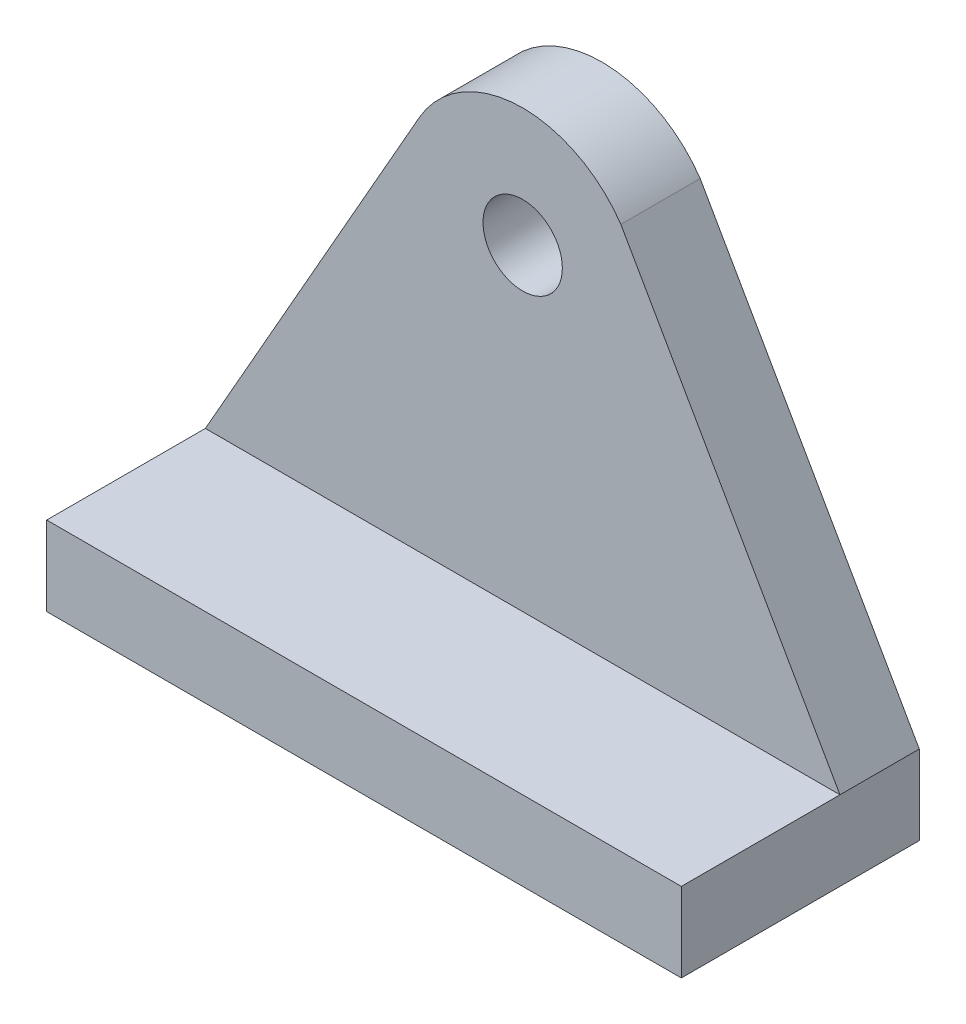
ISO-10303-21;
HEADER;
FILE_DESCRIPTION(('STEP AP214'),'2;1');
FILE_NAME('part.step','',(''),(''),'','','');
FILE_SCHEMA(('AUTOMOTIVE_DESIGN { 1 0 10303 214 1 1 1 1 }'));
ENDSEC;
DATA;
#1=APPLICATION_CONTEXT('core data for automotive mechanical design processes');
#2=APPLICATION_PROTOCOL_DEFINITION('international standard','automotive_design',2000,#1);
#3=PRODUCT_CONTEXT('',#1,'mechanical');
#4=PRODUCT('Part','Part','',(#3));
#5=PRODUCT_RELATED_PRODUCT_CATEGORY('part','',(#4));
#6=PRODUCT_DEFINITION_FORMATION('','',#4);
#7=PRODUCT_DEFINITION_CONTEXT('part definition',#1,'design');
#8=PRODUCT_DEFINITION('design','',#6,#7);
#9=PRODUCT_DEFINITION_SHAPE('','',#8);
#10=(LENGTH_UNIT() NAMED_UNIT(*) SI_UNIT(.MILLI.,.METRE.));
#11=(NAMED_UNIT(*) PLANE_ANGLE_UNIT() SI_UNIT($,.RADIAN.));
#12=(NAMED_UNIT(*) SI_UNIT($,.STERADIAN.) SOLID_ANGLE_UNIT());
#13=UNCERTAINTY_MEASURE_WITH_UNIT(LENGTH_MEASURE(1.E-05),#10,'distance_accuracy_value','');
#14=(GEOMETRIC_REPRESENTATION_CONTEXT(3) GLOBAL_UNCERTAINTY_ASSIGNED_CONTEXT((#13)) GLOBAL_UNIT_ASSIGNED_CONTEXT((#10,
#11,#12)) REPRESENTATION_CONTEXT('',''));
#15=CARTESIAN_POINT('',(0.,0.,0.));
#16=DIRECTION('',(0.,0.,1.));
#17=DIRECTION('',(1.,0.,0.));
#18=AXIS2_PLACEMENT_3D('',#15,#16,#17);
#19=CARTESIAN_POINT('',(10.27413218417,-11.9907770580973,2.));
#20=DIRECTION('',(-0.868834468468279,-0.495102682684555,0.));
#21=DIRECTION('',(0.495102682684555,-0.868834468468279,0.));
#22=AXIS2_PLACEMENT_3D('',#19,#20,#21);
#23=PLANE('',#22);
#24=DIRECTION('',(-0.495102682684555,0.868834468468279,0.));
#25=VECTOR('',#24,1.);
#26=CARTESIAN_POINT('',(10.27413218417,-11.9907770580973,0.));
#27=LINE('',#26,#25);
#28=CARTESIAN_POINT('',(8.,-8.,0.));
#29=VERTEX_POINT('',#28);
#30=CARTESIAN_POINT('',(2.47563651299595,1.6944686056464,0.));
#31=VERTEX_POINT('',#30);
#32=EDGE_CURVE('E173',#29,#31,#27,.T.);
#33=ORIENTED_EDGE('',*,*,#32,.T.);
#34=DIRECTION('',(0.,0.,-1.));
#35=VECTOR('',#34,1.);
#36=CARTESIAN_POINT('',(2.47563651299595,1.6944686056464,2.));
#37=LINE('',#36,#35);
#38=CARTESIAN_POINT('',(2.47563651299595,1.6944686056464,2.));
#39=VERTEX_POINT('',#38);
#40=EDGE_CURVE('E11',#39,#31,#37,.T.);
#41=ORIENTED_EDGE('',*,*,#40,.F.);
#42=DIRECTION('',(-0.495102682684555,0.868834468468279,0.));
#43=VECTOR('',#42,1.);
#44=CARTESIAN_POINT('',(10.27413218417,-11.9907770580973,2.));
#45=LINE('',#44,#43);
#46=CARTESIAN_POINT('',(8.,-8.,2.));
#47=VERTEX_POINT('',#46);
#48=EDGE_CURVE('E52',#47,#39,#45,.T.);
#49=ORIENTED_EDGE('',*,*,#48,.F.);
#50=DIRECTION('',(0.,0.,-1.));
#51=VECTOR('',#50,1.);
#52=CARTESIAN_POINT('',(8.,-8.,2.));
#53=LINE('',#52,#51);
#54=EDGE_CURVE('E74',#47,#29,#53,.T.);
#55=ORIENTED_EDGE('',*,*,#54,.T.);
#56=EDGE_LOOP('',(#33,#41,#49,#55));
#57=FACE_BOUND('',#56,.T.);
#58=ADVANCED_FACE('F33',(#57),#23,.F.);
#59=CARTESIAN_POINT('',(0.,0.,2.));
#60=DIRECTION('',(0.,0.,-1.));
#61=DIRECTION('',(-1.,0.,0.));
#62=AXIS2_PLACEMENT_3D('',#59,#60,#61);
#63=CYLINDRICAL_SURFACE('',#62,3.);
#64=CARTESIAN_POINT('',(0.,0.,0.));
#65=DIRECTION('',(0.,0.,1.));
#66=DIRECTION('',(1.,0.,0.));
#67=AXIS2_PLACEMENT_3D('',#64,#65,#66);
#68=CIRCLE('',#67,3.);
#69=CARTESIAN_POINT('',(-2.6078835214942,1.48288352149419,0.));
#70=VERTEX_POINT('',#69);
#71=EDGE_CURVE('E176',#31,#70,#68,.T.);
#72=ORIENTED_EDGE('',*,*,#71,.T.);
#73=DIRECTION('',(0.,0.,-1.));
#74=VECTOR('',#73,1.);
#75=CARTESIAN_POINT('',(-2.6078835214942,1.48288352149419,2.));
#76=LINE('',#75,#74);
#77=CARTESIAN_POINT('',(-2.6078835214942,1.48288352149419,2.));
#78=VERTEX_POINT('',#77);
#79=EDGE_CURVE('E43',#78,#70,#76,.T.);
#80=ORIENTED_EDGE('',*,*,#79,.F.);
#81=CARTESIAN_POINT('',(0.,0.,2.));
#82=DIRECTION('',(0.,0.,1.));
#83=DIRECTION('',(1.,0.,0.));
#84=AXIS2_PLACEMENT_3D('',#81,#82,#83);
#85=CIRCLE('',#84,3.);
#86=EDGE_CURVE('E79',#39,#78,#85,.T.);
#87=ORIENTED_EDGE('',*,*,#86,.F.);
#88=ORIENTED_EDGE('',*,*,#40,.T.);
#89=EDGE_LOOP('',(#72,#80,#87,#88));
#90=FACE_BOUND('',#89,.T.);
#91=ADVANCED_FACE('F175',(#90),#63,.T.);
#92=CARTESIAN_POINT('',(-10.2758546472716,-12.0024477620166,2.));
#93=DIRECTION('',(-0.869294507164732,0.494294507164732,0.));
#94=DIRECTION('',(-0.494294507164732,-0.869294507164732,0.));
#95=AXIS2_PLACEMENT_3D('',#92,#93,#94);
#96=PLANE('',#95);
#97=DIRECTION('',(0.494294507164732,0.869294507164732,0.));
#98=VECTOR('',#97,1.);
#99=CARTESIAN_POINT('',(-10.2758546472716,-12.0024477620166,0.));
#100=LINE('',#99,#98);
#101=CARTESIAN_POINT('',(-8.,-8.,0.));
#102=VERTEX_POINT('',#101);
#103=EDGE_CURVE('E70',#102,#70,#100,.T.);
#104=ORIENTED_EDGE('',*,*,#103,.F.);
#105=DIRECTION('',(0.,0.,-1.));
#106=VECTOR('',#105,1.);
#107=CARTESIAN_POINT('',(-8.,-8.,2.));
#108=LINE('',#107,#106);
#109=CARTESIAN_POINT('',(-8.,-8.,2.));
#110=VERTEX_POINT('',#109);
#111=EDGE_CURVE('E165',#110,#102,#108,.T.);
#112=ORIENTED_EDGE('',*,*,#111,.F.);
#113=DIRECTION('',(0.494294507164732,0.869294507164732,0.));
#114=VECTOR('',#113,1.);
#115=CARTESIAN_POINT('',(-10.2758546472716,-12.0024477620166,2.));
#116=LINE('',#115,#114);
#117=EDGE_CURVE('E152',#110,#78,#116,.T.);
#118=ORIENTED_EDGE('',*,*,#117,.T.);
#119=ORIENTED_EDGE('',*,*,#79,.T.);
#120=EDGE_LOOP('',(#104,#112,#118,#119));
#121=FACE_BOUND('',#120,.T.);
#122=ADVANCED_FACE('F182',(#121),#96,.T.);
#123=CARTESIAN_POINT('',(0.,0.,2.));
#124=DIRECTION('',(0.,0.,-1.));
#125=DIRECTION('',(-1.,0.,0.));
#126=AXIS2_PLACEMENT_3D('',#123,#124,#125);
#127=CYLINDRICAL_SURFACE('',#126,0.999999999999999);
#128=CARTESIAN_POINT('',(0.,0.,2.));
#129=DIRECTION('',(0.,0.,1.));
#130=DIRECTION('',(1.,0.,0.));
#131=AXIS2_PLACEMENT_3D('',#128,#129,#130);
#132=CIRCLE('',#131,0.999999999999999);
#133=CARTESIAN_POINT('',(0.999999999999999,0.,2.));
#134=VERTEX_POINT('',#133);
#135=EDGE_CURVE('E148',#134,#134,#132,.T.);
#136=ORIENTED_EDGE('',*,*,#135,.T.);
#137=EDGE_LOOP('',(#136));
#138=FACE_BOUND('',#137,.T.);
#139=CARTESIAN_POINT('',(0.,0.,0.));
#140=DIRECTION('',(0.,0.,1.));
#141=DIRECTION('',(1.,0.,0.));
#142=AXIS2_PLACEMENT_3D('',#139,#140,#141);
#143=CIRCLE('',#142,0.999999999999999);
#144=CARTESIAN_POINT('',(0.999999999999999,0.,0.));
#145=VERTEX_POINT('',#144);
#146=EDGE_CURVE('E146',#145,#145,#143,.T.);
#147=ORIENTED_EDGE('',*,*,#146,.F.);
#148=EDGE_LOOP('',(#147));
#149=FACE_BOUND('',#148,.T.);
#150=ADVANCED_FACE('F35',(#138,#149),#127,.F.);
#151=CARTESIAN_POINT('',(0.,-17.8454600745366,2.));
#152=DIRECTION('',(0.,0.,1.));
#153=DIRECTION('',(1.,0.,0.));
#154=AXIS2_PLACEMENT_3D('',#151,#152,#153);
#155=PLANE('',#154);
#156=ORIENTED_EDGE('',*,*,#135,.F.);
#157=EDGE_LOOP('',(#156));
#158=FACE_BOUND('',#157,.T.);
#159=ORIENTED_EDGE('',*,*,#48,.T.);
#160=ORIENTED_EDGE('',*,*,#86,.T.);
#161=ORIENTED_EDGE('',*,*,#117,.F.);
#162=DIRECTION('',(-1.,0.,0.));
#163=VECTOR('',#162,1.);
#164=CARTESIAN_POINT('',(0.,-8.,2.));
#165=LINE('',#164,#163);
#166=EDGE_CURVE('E157',#47,#110,#165,.T.);
#167=ORIENTED_EDGE('',*,*,#166,.F.);
#168=EDGE_LOOP('',(#159,#160,#161,#167));
#169=FACE_BOUND('',#168,.T.);
#170=ADVANCED_FACE('F172',(#158,#169),#155,.T.);
#171=CARTESIAN_POINT('',(0.,-17.8454600745366,0.));
#172=DIRECTION('',(0.,0.,1.));
#173=DIRECTION('',(1.,0.,0.));
#174=AXIS2_PLACEMENT_3D('',#171,#172,#173);
#175=PLANE('',#174);
#176=ORIENTED_EDGE('',*,*,#146,.T.);
#177=EDGE_LOOP('',(#176));
#178=FACE_BOUND('',#177,.T.);
#179=ORIENTED_EDGE('',*,*,#32,.F.);
#180=DIRECTION('',(0.,-1.,0.));
#181=VECTOR('',#180,1.);
#182=CARTESIAN_POINT('',(8.,-8.,0.));
#183=LINE('',#182,#181);
#184=CARTESIAN_POINT('',(8.,-10.,0.));
#185=VERTEX_POINT('',#184);
#186=EDGE_CURVE('E136',#29,#185,#183,.T.);
#187=ORIENTED_EDGE('',*,*,#186,.T.);
#188=DIRECTION('',(-1.,0.,0.));
#189=VECTOR('',#188,1.);
#190=CARTESIAN_POINT('',(8.,-10.,0.));
#191=LINE('',#190,#189);
#192=CARTESIAN_POINT('',(-8.,-10.,0.));
#193=VERTEX_POINT('',#192);
#194=EDGE_CURVE('E108',#185,#193,#191,.T.);
#195=ORIENTED_EDGE('',*,*,#194,.T.);
#196=DIRECTION('',(0.,1.,0.));
#197=VECTOR('',#196,1.);
#198=CARTESIAN_POINT('',(-8.,-8.,0.));
#199=LINE('',#198,#197);
#200=EDGE_CURVE('E129',#193,#102,#199,.T.);
#201=ORIENTED_EDGE('',*,*,#200,.T.);
#202=ORIENTED_EDGE('',*,*,#103,.T.);
#203=ORIENTED_EDGE('',*,*,#71,.F.);
#204=EDGE_LOOP('',(#179,#187,#195,#201,#202,#203));
#205=FACE_BOUND('',#204,.T.);
#206=ADVANCED_FACE('F179',(#178,#205),#175,.F.);
#207=CARTESIAN_POINT('',(8.,-8.,6.));
#208=DIRECTION('',(1.,0.,0.));
#209=DIRECTION('',(0.,0.,-1.));
#210=AXIS2_PLACEMENT_3D('',#207,#208,#209);
#211=PLANE('',#210);
#212=ORIENTED_EDGE('',*,*,#186,.F.);
#213=ORIENTED_EDGE('',*,*,#54,.F.);
#214=DIRECTION('',(0.,0.,-1.));
#215=VECTOR('',#214,1.);
#216=CARTESIAN_POINT('',(8.,-8.,6.));
#217=LINE('',#216,#215);
#218=CARTESIAN_POINT('',(8.,-8.,6.));
#219=VERTEX_POINT('',#218);
#220=EDGE_CURVE('E128',#219,#47,#217,.T.);
#221=ORIENTED_EDGE('',*,*,#220,.F.);
#222=DIRECTION('',(0.,-1.,0.));
#223=VECTOR('',#222,1.);
#224=CARTESIAN_POINT('',(8.,-8.,6.));
#225=LINE('',#224,#223);
#226=CARTESIAN_POINT('',(8.,-10.,6.));
#227=VERTEX_POINT('',#226);
#228=EDGE_CURVE('E121',#219,#227,#225,.T.);
#229=ORIENTED_EDGE('',*,*,#228,.T.);
#230=DIRECTION('',(0.,0.,-1.));
#231=VECTOR('',#230,1.);
#232=CARTESIAN_POINT('',(8.,-10.,6.));
#233=LINE('',#232,#231);
#234=EDGE_CURVE('E103',#227,#185,#233,.T.);
#235=ORIENTED_EDGE('',*,*,#234,.T.);
#236=EDGE_LOOP('',(#212,#213,#221,#229,#235));
#237=FACE_BOUND('',#236,.T.);
#238=ADVANCED_FACE('F126',(#237),#211,.T.);
#239=CARTESIAN_POINT('',(8.,-8.,6.));
#240=DIRECTION('',(0.,1.,0.));
#241=DIRECTION('',(0.,0.,1.));
#242=AXIS2_PLACEMENT_3D('',#239,#240,#241);
#243=PLANE('',#242);
#244=ORIENTED_EDGE('',*,*,#220,.T.);
#245=ORIENTED_EDGE('',*,*,#166,.T.);
#246=DIRECTION('',(0.,0.,-1.));
#247=VECTOR('',#246,1.);
#248=CARTESIAN_POINT('',(-8.,-8.,6.));
#249=LINE('',#248,#247);
#250=CARTESIAN_POINT('',(-8.,-8.,6.));
#251=VERTEX_POINT('',#250);
#252=EDGE_CURVE('E147',#251,#110,#249,.T.);
#253=ORIENTED_EDGE('',*,*,#252,.F.);
#254=DIRECTION('',(1.,0.,0.));
#255=VECTOR('',#254,1.);
#256=CARTESIAN_POINT('',(8.,-8.,6.));
#257=LINE('',#256,#255);
#258=EDGE_CURVE('E114',#251,#219,#257,.T.);
#259=ORIENTED_EDGE('',*,*,#258,.T.);
#260=EDGE_LOOP('',(#244,#245,#253,#259));
#261=FACE_BOUND('',#260,.T.);
#262=ADVANCED_FACE('F186',(#261),#243,.T.);
#263=CARTESIAN_POINT('',(-8.,-8.,6.));
#264=DIRECTION('',(-1.,0.,0.));
#265=DIRECTION('',(0.,0.,1.));
#266=AXIS2_PLACEMENT_3D('',#263,#264,#265);
#267=PLANE('',#266);
#268=ORIENTED_EDGE('',*,*,#200,.F.);
#269=DIRECTION('',(0.,0.,-1.));
#270=VECTOR('',#269,1.);
#271=CARTESIAN_POINT('',(-8.,-10.,6.));
#272=LINE('',#271,#270);
#273=CARTESIAN_POINT('',(-8.,-10.,6.));
#274=VERTEX_POINT('',#273);
#275=EDGE_CURVE('E113',#274,#193,#272,.T.);
#276=ORIENTED_EDGE('',*,*,#275,.F.);
#277=DIRECTION('',(0.,1.,0.));
#278=VECTOR('',#277,1.);
#279=CARTESIAN_POINT('',(-8.,-8.,6.));
#280=LINE('',#279,#278);
#281=EDGE_CURVE('E124',#274,#251,#280,.T.);
#282=ORIENTED_EDGE('',*,*,#281,.T.);
#283=ORIENTED_EDGE('',*,*,#252,.T.);
#284=ORIENTED_EDGE('',*,*,#111,.T.);
#285=EDGE_LOOP('',(#268,#276,#282,#283,#284));
#286=FACE_BOUND('',#285,.T.);
#287=ADVANCED_FACE('F187',(#286),#267,.T.);
#288=CARTESIAN_POINT('',(8.,-10.,6.));
#289=DIRECTION('',(0.,-1.,0.));
#290=DIRECTION('',(0.,0.,-1.));
#291=AXIS2_PLACEMENT_3D('',#288,#289,#290);
#292=PLANE('',#291);
#293=ORIENTED_EDGE('',*,*,#194,.F.);
#294=ORIENTED_EDGE('',*,*,#234,.F.);
#295=DIRECTION('',(-1.,0.,0.));
#296=VECTOR('',#295,1.);
#297=CARTESIAN_POINT('',(8.,-10.,6.));
#298=LINE('',#297,#296);
#299=EDGE_CURVE('E106',#227,#274,#298,.T.);
#300=ORIENTED_EDGE('',*,*,#299,.T.);
#301=ORIENTED_EDGE('',*,*,#275,.T.);
#302=EDGE_LOOP('',(#293,#294,#300,#301));
#303=FACE_BOUND('',#302,.T.);
#304=ADVANCED_FACE('F105',(#303),#292,.T.);
#305=CARTESIAN_POINT('',(8.,-10.,6.));
#306=DIRECTION('',(0.,0.,-1.));
#307=DIRECTION('',(-1.,0.,0.));
#308=AXIS2_PLACEMENT_3D('',#305,#306,#307);
#309=PLANE('',#308);
#310=ORIENTED_EDGE('',*,*,#228,.F.);
#311=ORIENTED_EDGE('',*,*,#258,.F.);
#312=ORIENTED_EDGE('',*,*,#281,.F.);
#313=ORIENTED_EDGE('',*,*,#299,.F.);
#314=EDGE_LOOP('',(#310,#311,#312,#313));
#315=FACE_BOUND('',#314,.T.);
#316=ADVANCED_FACE('F119',(#315),#309,.F.);
#317=CLOSED_SHELL('',(#58,#91,#122,#150,#170,#206,#238,#262,#287,#304,#316));
#318=MANIFOLD_SOLID_BREP('B2',#317);
#319=ADVANCED_BREP_SHAPE_REPRESENTATION('',(#18,#318),#14);
#320=SHAPE_DEFINITION_REPRESENTATION(#9,#319);
ENDSEC;
END-ISO-10303-21;
